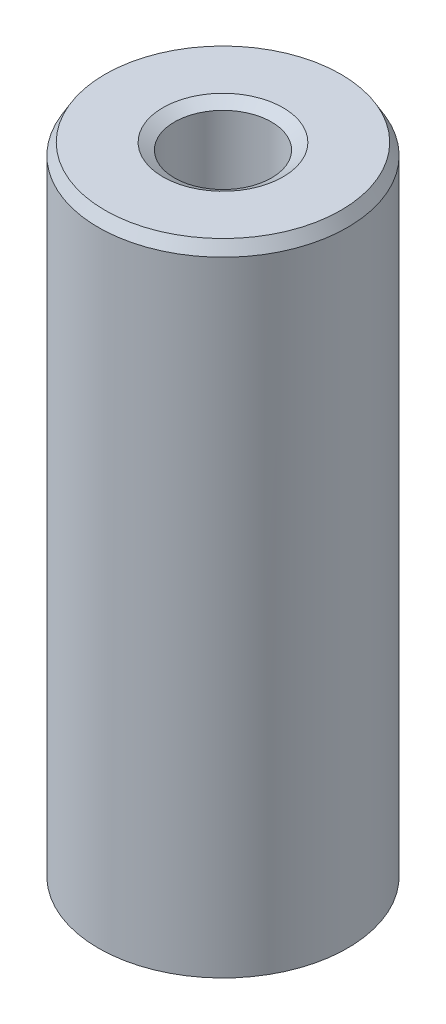
ISO-10303-21;
HEADER;
FILE_DESCRIPTION(('STEP AP214'),'2;1');
FILE_NAME('part.step','',(''),(''),'','','');
FILE_SCHEMA(('AUTOMOTIVE_DESIGN { 1 0 10303 214 1 1 1 1 }'));
ENDSEC;
DATA;
#1=APPLICATION_CONTEXT('core data for automotive mechanical design processes');
#2=APPLICATION_PROTOCOL_DEFINITION('international standard','automotive_design',2000,#1);
#3=PRODUCT_CONTEXT('',#1,'mechanical');
#4=PRODUCT('Part','Part','',(#3));
#5=PRODUCT_RELATED_PRODUCT_CATEGORY('part','',(#4));
#6=PRODUCT_DEFINITION_FORMATION('','',#4);
#7=PRODUCT_DEFINITION_CONTEXT('part definition',#1,'design');
#8=PRODUCT_DEFINITION('design','',#6,#7);
#9=PRODUCT_DEFINITION_SHAPE('','',#8);
#10=(LENGTH_UNIT() NAMED_UNIT(*) SI_UNIT(.MILLI.,.METRE.));
#11=(NAMED_UNIT(*) PLANE_ANGLE_UNIT() SI_UNIT($,.RADIAN.));
#12=(NAMED_UNIT(*) SI_UNIT($,.STERADIAN.) SOLID_ANGLE_UNIT());
#13=UNCERTAINTY_MEASURE_WITH_UNIT(LENGTH_MEASURE(1.E-05),#10,'distance_accuracy_value','');
#14=(GEOMETRIC_REPRESENTATION_CONTEXT(3) GLOBAL_UNCERTAINTY_ASSIGNED_CONTEXT((#13)) GLOBAL_UNIT_ASSIGNED_CONTEXT((#10,
#11,#12)) REPRESENTATION_CONTEXT('',''));
#15=CARTESIAN_POINT('',(0.,0.,0.));
#16=DIRECTION('',(0.,0.,1.));
#17=DIRECTION('',(1.,0.,0.));
#18=AXIS2_PLACEMENT_3D('',#15,#16,#17);
#19=CARTESIAN_POINT('',(0.,180.484742913533,0.));
#20=DIRECTION('',(0.,-1.,0.));
#21=DIRECTION('',(0.,0.,-1.));
#22=AXIS2_PLACEMENT_3D('',#19,#20,#21);
#23=CYLINDRICAL_SURFACE('',#22,35.);
#24=CARTESIAN_POINT('',(0.,1.86802596022742,0.));
#25=DIRECTION('',(0.,1.,0.));
#26=DIRECTION('',(0.,0.,1.));
#27=AXIS2_PLACEMENT_3D('',#24,#25,#26);
#28=CIRCLE('',#27,35.);
#29=CARTESIAN_POINT('',(0.,1.86802596022742,35.));
#30=VERTEX_POINT('',#29);
#31=EDGE_CURVE('E10',#30,#30,#28,.T.);
#32=ORIENTED_EDGE('',*,*,#31,.T.);
#33=EDGE_LOOP('',(#32));
#34=FACE_BOUND('',#33,.T.);
#35=CARTESIAN_POINT('',(0.,177.249227040561,0.));
#36=DIRECTION('',(0.,1.,0.));
#37=DIRECTION('',(0.,0.,1.));
#38=AXIS2_PLACEMENT_3D('',#35,#36,#37);
#39=CIRCLE('',#38,35.);
#40=CARTESIAN_POINT('',(0.,177.249227040561,-35.));
#41=VERTEX_POINT('',#40);
#42=EDGE_CURVE('E50',#41,#41,#39,.F.);
#43=ORIENTED_EDGE('',*,*,#42,.T.);
#44=EDGE_LOOP('',(#43));
#45=FACE_BOUND('',#44,.T.);
#46=ADVANCED_FACE('F39',(#34,#45),#23,.T.);
#47=CARTESIAN_POINT('',(0.,180.484742913533,0.));
#48=DIRECTION('',(0.,1.,0.));
#49=DIRECTION('',(0.,0.,1.));
#50=AXIS2_PLACEMENT_3D('',#47,#48,#49);
#51=PLANE('',#50);
#52=CARTESIAN_POINT('',(0.,180.484742913533,0.));
#53=DIRECTION('',(0.,1.,0.));
#54=DIRECTION('',(0.,0.,1.));
#55=AXIS2_PLACEMENT_3D('',#52,#53,#54);
#56=CIRCLE('',#55,16.8723935439699);
#57=CARTESIAN_POINT('',(0.,180.484742913533,16.8723935439698));
#58=VERTEX_POINT('',#57);
#59=EDGE_CURVE('E58',#58,#58,#56,.F.);
#60=ORIENTED_EDGE('',*,*,#59,.T.);
#61=EDGE_LOOP('',(#60));
#62=FACE_BOUND('',#61,.T.);
#63=CARTESIAN_POINT('',(0.,180.484742913533,0.));
#64=DIRECTION('',(0.,1.,0.));
#65=DIRECTION('',(0.,0.,1.));
#66=AXIS2_PLACEMENT_3D('',#63,#64,#65);
#67=CIRCLE('',#66,33.1319740397725);
#68=CARTESIAN_POINT('',(0.,180.484742913533,-33.1319740397726));
#69=VERTEX_POINT('',#68);
#70=EDGE_CURVE('E61',#69,#69,#67,.T.);
#71=ORIENTED_EDGE('',*,*,#70,.T.);
#72=EDGE_LOOP('',(#71));
#73=FACE_BOUND('',#72,.T.);
#74=ADVANCED_FACE('F88',(#62,#73),#51,.T.);
#75=CARTESIAN_POINT('',(0.,0.,0.));
#76=DIRECTION('',(0.,1.,0.));
#77=DIRECTION('',(0.,0.,1.));
#78=AXIS2_PLACEMENT_3D('',#75,#76,#77);
#79=PLANE('',#78);
#80=CARTESIAN_POINT('',(0.,0.,0.));
#81=DIRECTION('',(0.,1.,0.));
#82=DIRECTION('',(0.,0.,1.));
#83=AXIS2_PLACEMENT_3D('',#80,#81,#82);
#84=CIRCLE('',#83,15.5049036312257);
#85=CARTESIAN_POINT('',(0.,0.,15.5049036312257));
#86=VERTEX_POINT('',#85);
#87=EDGE_CURVE('E51',#86,#86,#84,.T.);
#88=ORIENTED_EDGE('',*,*,#87,.T.);
#89=EDGE_LOOP('',(#88));
#90=FACE_BOUND('',#89,.T.);
#91=CARTESIAN_POINT('',(0.,0.,0.));
#92=DIRECTION('',(0.,1.,0.));
#93=DIRECTION('',(0.,0.,1.));
#94=AXIS2_PLACEMENT_3D('',#91,#92,#93);
#95=CIRCLE('',#94,31.7644841270285);
#96=CARTESIAN_POINT('',(0.,0.,31.7644841270285));
#97=VERTEX_POINT('',#96);
#98=EDGE_CURVE('E54',#97,#97,#95,.F.);
#99=ORIENTED_EDGE('',*,*,#98,.T.);
#100=EDGE_LOOP('',(#99));
#101=FACE_BOUND('',#100,.T.);
#102=ADVANCED_FACE('F83',(#90,#101),#79,.F.);
#103=CARTESIAN_POINT('',(0.,180.484742913533,0.));
#104=DIRECTION('',(0.,-1.,0.));
#105=DIRECTION('',(0.,0.,-1.));
#106=AXIS2_PLACEMENT_3D('',#103,#104,#105);
#107=CYLINDRICAL_SURFACE('',#106,13.6368776709983);
#108=CARTESIAN_POINT('',(0.,178.616716953305,0.));
#109=DIRECTION('',(0.,1.,0.));
#110=DIRECTION('',(0.,0.,1.));
#111=AXIS2_PLACEMENT_3D('',#108,#109,#110);
#112=CIRCLE('',#111,13.6368776709983);
#113=CARTESIAN_POINT('',(0.,178.616716953305,13.6368776709983));
#114=VERTEX_POINT('',#113);
#115=EDGE_CURVE('E67',#114,#114,#112,.T.);
#116=ORIENTED_EDGE('',*,*,#115,.T.);
#117=EDGE_LOOP('',(#116));
#118=FACE_BOUND('',#117,.T.);
#119=CARTESIAN_POINT('',(0.,3.23551587297152,0.));
#120=DIRECTION('',(0.,1.,0.));
#121=DIRECTION('',(0.,0.,1.));
#122=AXIS2_PLACEMENT_3D('',#119,#120,#121);
#123=CIRCLE('',#122,13.6368776709983);
#124=CARTESIAN_POINT('',(0.,3.23551587297152,13.6368776709983));
#125=VERTEX_POINT('',#124);
#126=EDGE_CURVE('E69',#125,#125,#123,.F.);
#127=ORIENTED_EDGE('',*,*,#126,.T.);
#128=EDGE_LOOP('',(#127));
#129=FACE_BOUND('',#128,.T.);
#130=ADVANCED_FACE('F71',(#118,#129),#107,.F.);
#131=CARTESIAN_POINT('',(0.,178.616716953305,0.));
#132=DIRECTION('',(0.,1.,0.));
#133=DIRECTION('',(0.,0.,1.));
#134=AXIS2_PLACEMENT_3D('',#131,#132,#133);
#135=CONICAL_SURFACE('',#134,13.6368776709983,1.0471975511966);
#136=CARTESIAN_POINT('',(0.,180.484742913533,16.8723935439698));
#137=CARTESIAN_POINT('',(0.,180.46528430978,16.8386902536264));
#138=CARTESIAN_POINT('',(0.,180.445825706028,16.8049869632829));
#139=CARTESIAN_POINT('',(0.,180.406908498523,16.737580382596));
#140=CARTESIAN_POINT('',(0.,180.387449894771,16.7038770922526));
#141=CARTESIAN_POINT('',(0.,180.348532687266,16.6364705115657));
#142=CARTESIAN_POINT('',(0.,180.329074083514,16.6027672212222));
#143=CARTESIAN_POINT('',(0.,180.290156876009,16.5353606405353));
#144=CARTESIAN_POINT('',(0.,180.270698272257,16.5016573501918));
#145=CARTESIAN_POINT('',(0.,180.231781064752,16.4342507695049));
#146=CARTESIAN_POINT('',(0.,180.212322461,16.4005474791615));
#147=CARTESIAN_POINT('',(0.,180.173405253495,16.3331408984746));
#148=CARTESIAN_POINT('',(0.,180.153946649743,16.2994376081311));
#149=CARTESIAN_POINT('',(0.,180.115029442238,16.2320310274442));
#150=CARTESIAN_POINT('',(0.,180.095570838485,16.1983277371008));
#151=CARTESIAN_POINT('',(0.,180.056653630981,16.1309211564138));
#152=CARTESIAN_POINT('',(0.,180.037195027228,16.0972178660704));
#153=CARTESIAN_POINT('',(0.,179.998277819724,16.0298112853835));
#154=CARTESIAN_POINT('',(0.,179.978819215971,15.99610799504));
#155=CARTESIAN_POINT('',(0.,179.939902008467,15.9287014143531));
#156=CARTESIAN_POINT('',(0.,179.920443404714,15.8949981240097));
#157=CARTESIAN_POINT('',(0.,179.881526197209,15.8275915433228));
#158=CARTESIAN_POINT('',(0.,179.862067593457,15.7938882529793));
#159=CARTESIAN_POINT('',(0.,179.823150385952,15.7264816722924));
#160=CARTESIAN_POINT('',(0.,179.8036917822,15.6927783819489));
#161=CARTESIAN_POINT('',(0.,179.764774574695,15.625371801262));
#162=CARTESIAN_POINT('',(0.,179.745315970943,15.5916685109186));
#163=CARTESIAN_POINT('',(0.,179.706398763438,15.5242619302317));
#164=CARTESIAN_POINT('',(0.,179.686940159686,15.4905586398882));
#165=CARTESIAN_POINT('',(0.,179.648022952181,15.4231520592013));
#166=CARTESIAN_POINT('',(0.,179.628564348429,15.3894487688579));
#167=CARTESIAN_POINT('',(0.,179.589647140924,15.322042188171));
#168=CARTESIAN_POINT('',(0.,179.570188537172,15.2883388978275));
#169=CARTESIAN_POINT('',(0.,179.531271329667,15.2209323171406));
#170=CARTESIAN_POINT('',(0.,179.511812725914,15.1872290267971));
#171=CARTESIAN_POINT('',(0.,179.47289551841,15.1198224461102));
#172=CARTESIAN_POINT('',(0.,179.453436914657,15.0861191557668));
#173=CARTESIAN_POINT('',(0.,179.414519707153,15.0187125750799));
#174=CARTESIAN_POINT('',(0.,179.3950611034,14.9850092847364));
#175=CARTESIAN_POINT('',(0.,179.356143895895,14.9176027040495));
#176=CARTESIAN_POINT('',(0.,179.336685292143,14.8838994137061));
#177=CARTESIAN_POINT('',(0.,179.297768084638,14.8164928330191));
#178=CARTESIAN_POINT('',(0.,179.278309480886,14.7827895426757));
#179=CARTESIAN_POINT('',(0.,179.239392273381,14.7153829619888));
#180=CARTESIAN_POINT('',(0.,179.219933669629,14.6816796716453));
#181=CARTESIAN_POINT('',(0.,179.181016462124,14.6142730909584));
#182=CARTESIAN_POINT('',(0.,179.161557858372,14.580569800615));
#183=CARTESIAN_POINT('',(0.,179.122640650867,14.5131632199281));
#184=CARTESIAN_POINT('',(0.,179.103182047115,14.4794599295846));
#185=CARTESIAN_POINT('',(0.,179.06426483961,14.4120533488977));
#186=CARTESIAN_POINT('',(0.,179.044806235858,14.3783500585543));
#187=CARTESIAN_POINT('',(0.,179.005889028353,14.3109434778673));
#188=CARTESIAN_POINT('',(0.,178.9864304246,14.2772401875239));
#189=CARTESIAN_POINT('',(0.,178.947513217096,14.209833606837));
#190=CARTESIAN_POINT('',(0.,178.928054613343,14.1761303164935));
#191=CARTESIAN_POINT('',(0.,178.889137405839,14.1087237358066));
#192=CARTESIAN_POINT('',(0.,178.869678802086,14.0750204454632));
#193=CARTESIAN_POINT('',(0.,178.830761594581,14.0076138647763));
#194=CARTESIAN_POINT('',(0.,178.811302990829,13.9739105744328));
#195=CARTESIAN_POINT('',(0.,178.772385783324,13.9065039937459));
#196=CARTESIAN_POINT('',(0.,178.752927179572,13.8728007034024));
#197=CARTESIAN_POINT('',(0.,178.714009972067,13.8053941227155));
#198=CARTESIAN_POINT('',(0.,178.694551368315,13.7716908323721));
#199=CARTESIAN_POINT('',(0.,178.65563416081,13.7042842516852));
#200=CARTESIAN_POINT('',(0.,178.636175557058,13.6705809613417));
#201=CARTESIAN_POINT('',(0.,178.616716953305,13.6368776709983));
#202=B_SPLINE_CURVE_WITH_KNOTS('',3,(#136,#137,#138,#139,#140,#141,#142,#143,#144,#145,#146,
#147,#148,#149,#150,#151,#152,#153,#154,#155,#156,#157,#158,#159,#160,#161,#162,#163,#164,#165,
#166,#167,#168,#169,#170,#171,#172,#173,#174,#175,#176,#177,#178,#179,#180,#181,#182,#183,#184,
#185,#186,#187,#188,#189,#190,#191,#192,#193,#194,#195,#196,#197,#198,#199,#200,#201),
.UNSPECIFIED.,.F.,.F.,(4,2,2,2,2,2,2,2,2,2,2,2,2,2,2,2,2,2,2,2,2,2,2,2,2,2,2,2,2,2,2,2,4),(0.,
0.116751622514219,0.233503245028438,0.350254867542657,0.467006490056862,0.583758112571085,
0.700509735085304,0.817261357599509,0.934012980113728,1.05076460262795,1.16751622514215,
1.28426784765637,1.40101947017059,1.5177710926848,1.63452271519902,1.75127433771324,
1.86802596022744,1.98477758274166,2.10152920525588,2.2182808277701,2.33503245028431,
2.45178407279853,2.56853569531274,2.68528731782695,2.80203894034117,2.91879056285539,
3.0355421853696,3.15229380788382,3.26904543039804,3.38579705291224,3.50254867542646,
3.61930029794068,3.73605192045489),.UNSPECIFIED.);
#203=EDGE_CURVE('BSEAM77',#58,#114,#202,.T.);
#204=ORIENTED_EDGE('',*,*,#59,.F.);
#205=ORIENTED_EDGE('',*,*,#115,.F.);
#206=ORIENTED_EDGE('',*,*,#203,.T.);
#207=ORIENTED_EDGE('',*,*,#203,.F.);
#208=EDGE_LOOP('',(#204,#206,#205,#207));
#209=FACE_BOUND('',#208,.T.);
#210=ADVANCED_FACE('F77',(#209),#135,.F.);
#211=CARTESIAN_POINT('',(0.,0.,0.));
#212=DIRECTION('',(0.,-1.,0.));
#213=DIRECTION('',(0.,0.,-1.));
#214=AXIS2_PLACEMENT_3D('',#211,#212,#213);
#215=CONICAL_SURFACE('',#214,15.5049036312257,0.523598775598298);
#216=ORIENTED_EDGE('',*,*,#126,.F.);
#217=EDGE_LOOP('',(#216));
#218=FACE_BOUND('',#217,.T.);
#219=ORIENTED_EDGE('',*,*,#87,.F.);
#220=EDGE_LOOP('',(#219));
#221=FACE_BOUND('',#220,.T.);
#222=ADVANCED_FACE('F73',(#218,#221),#215,.F.);
#223=CARTESIAN_POINT('',(0.,1.86802596022742,0.));
#224=DIRECTION('',(0.,1.,0.));
#225=DIRECTION('',(0.,0.,1.));
#226=AXIS2_PLACEMENT_3D('',#223,#224,#225);
#227=CONICAL_SURFACE('',#226,35.,1.0471975511966);
#228=ORIENTED_EDGE('',*,*,#98,.F.);
#229=EDGE_LOOP('',(#228));
#230=FACE_BOUND('',#229,.T.);
#231=ORIENTED_EDGE('',*,*,#31,.F.);
#232=EDGE_LOOP('',(#231));
#233=FACE_BOUND('',#232,.T.);
#234=ADVANCED_FACE('F76',(#230,#233),#227,.T.);
#235=CARTESIAN_POINT('',(0.,180.484742913533,0.));
#236=DIRECTION('',(0.,-1.,0.));
#237=DIRECTION('',(0.,0.,-1.));
#238=AXIS2_PLACEMENT_3D('',#235,#236,#237);
#239=CONICAL_SURFACE('',#238,33.1319740397725,0.523598775598296);
#240=CARTESIAN_POINT('',(0.,177.249227040561,-35.));
#241=CARTESIAN_POINT('',(0.,177.282930330905,-34.9805413962476));
#242=CARTESIAN_POINT('',(0.,177.316633621248,-34.9610827924953));
#243=CARTESIAN_POINT('',(0.,177.384040201935,-34.9221655849905));
#244=CARTESIAN_POINT('',(0.,177.417743492278,-34.9027069812382));
#245=CARTESIAN_POINT('',(0.,177.485150072965,-34.8637897737334));
#246=CARTESIAN_POINT('',(0.,177.518853363309,-34.8443311699811));
#247=CARTESIAN_POINT('',(0.,177.586259943996,-34.8054139624763));
#248=CARTESIAN_POINT('',(0.,177.619963234339,-34.785955358724));
#249=CARTESIAN_POINT('',(0.,177.687369815026,-34.7470381512192));
#250=CARTESIAN_POINT('',(0.,177.72107310537,-34.7275795474668));
#251=CARTESIAN_POINT('',(0.,177.788479686056,-34.6886623399621));
#252=CARTESIAN_POINT('',(0.,177.8221829764,-34.6692037362097));
#253=CARTESIAN_POINT('',(0.,177.889589557087,-34.630286528705));
#254=CARTESIAN_POINT('',(0.,177.92329284743,-34.6108279249526));
#255=CARTESIAN_POINT('',(0.,177.990699428117,-34.5719107174479));
#256=CARTESIAN_POINT('',(0.,178.024402718461,-34.5524521136955));
#257=CARTESIAN_POINT('',(0.,178.091809299148,-34.5135349061908));
#258=CARTESIAN_POINT('',(0.,178.125512589491,-34.4940763024384));
#259=CARTESIAN_POINT('',(0.,178.192919170178,-34.4551590949337));
#260=CARTESIAN_POINT('',(0.,178.226622460521,-34.4357004911813));
#261=CARTESIAN_POINT('',(0.,178.294029041208,-34.3967832836766));
#262=CARTESIAN_POINT('',(0.,178.327732331552,-34.3773246799242));
#263=CARTESIAN_POINT('',(0.,178.395138912239,-34.3384074724195));
#264=CARTESIAN_POINT('',(0.,178.428842202582,-34.3189488686671));
#265=CARTESIAN_POINT('',(0.,178.496248783269,-34.2800316611623));
#266=CARTESIAN_POINT('',(0.,178.529952073612,-34.26057305741));
#267=CARTESIAN_POINT('',(0.,178.597358654299,-34.2216558499052));
#268=CARTESIAN_POINT('',(0.,178.631061944643,-34.2021972461529));
#269=CARTESIAN_POINT('',(0.,178.69846852533,-34.1632800386481));
#270=CARTESIAN_POINT('',(0.,178.732171815673,-34.1438214348958));
#271=CARTESIAN_POINT('',(0.,178.79957839636,-34.104904227391));
#272=CARTESIAN_POINT('',(0.,178.833281686704,-34.0854456236387));
#273=CARTESIAN_POINT('',(0.,178.900688267391,-34.0465284161339));
#274=CARTESIAN_POINT('',(0.,178.934391557734,-34.0270698123815));
#275=CARTESIAN_POINT('',(0.,179.001798138421,-33.9881526048768));
#276=CARTESIAN_POINT('',(0.,179.035501428764,-33.9686940011244));
#277=CARTESIAN_POINT('',(0.,179.102908009451,-33.9297767936197));
#278=CARTESIAN_POINT('',(0.,179.136611299795,-33.9103181898673));
#279=CARTESIAN_POINT('',(0.,179.204017880482,-33.8714009823626));
#280=CARTESIAN_POINT('',(0.,179.237721170825,-33.8519423786102));
#281=CARTESIAN_POINT('',(0.,179.305127751512,-33.8130251711055));
#282=CARTESIAN_POINT('',(0.,179.338831041855,-33.7935665673531));
#283=CARTESIAN_POINT('',(0.,179.406237622542,-33.7546493598484));
#284=CARTESIAN_POINT('',(0.,179.439940912886,-33.735190756096));
#285=CARTESIAN_POINT('',(0.,179.507347493573,-33.6962735485913));
#286=CARTESIAN_POINT('',(0.,179.541050783916,-33.6768149448389));
#287=CARTESIAN_POINT('',(0.,179.608457364603,-33.6378977373341));
#288=CARTESIAN_POINT('',(0.,179.642160654946,-33.6184391335818));
#289=CARTESIAN_POINT('',(0.,179.709567235633,-33.579521926077));
#290=CARTESIAN_POINT('',(0.,179.743270525977,-33.5600633223247));
#291=CARTESIAN_POINT('',(0.,179.810677106664,-33.5211461148199));
#292=CARTESIAN_POINT('',(0.,179.844380397007,-33.5016875110676));
#293=CARTESIAN_POINT('',(0.,179.911786977694,-33.4627703035628));
#294=CARTESIAN_POINT('',(0.,179.945490268038,-33.4433116998105));
#295=CARTESIAN_POINT('',(0.,180.012896848724,-33.4043944923057));
#296=CARTESIAN_POINT('',(0.,180.046600139068,-33.3849358885534));
#297=CARTESIAN_POINT('',(0.,180.114006719755,-33.3460186810486));
#298=CARTESIAN_POINT('',(0.,180.147710010098,-33.3265600772963));
#299=CARTESIAN_POINT('',(0.,180.215116590785,-33.2876428697915));
#300=CARTESIAN_POINT('',(0.,180.248819881129,-33.2681842660391));
#301=CARTESIAN_POINT('',(0.,180.316226461816,-33.2292670585344));
#302=CARTESIAN_POINT('',(0.,180.349929752159,-33.209808454782));
#303=CARTESIAN_POINT('',(0.,180.417336332846,-33.1708912472773));
#304=CARTESIAN_POINT('',(0.,180.451039623189,-33.1514326435249));
#305=CARTESIAN_POINT('',(0.,180.484742913533,-33.1319740397726));
#306=B_SPLINE_CURVE_WITH_KNOTS('',3,(#240,#241,#242,#243,#244,#245,#246,#247,#248,#249,#250,
#251,#252,#253,#254,#255,#256,#257,#258,#259,#260,#261,#262,#263,#264,#265,#266,#267,#268,#269,
#270,#271,#272,#273,#274,#275,#276,#277,#278,#279,#280,#281,#282,#283,#284,#285,#286,#287,#288,
#289,#290,#291,#292,#293,#294,#295,#296,#297,#298,#299,#300,#301,#302,#303,#304,#305),
.UNSPECIFIED.,.F.,.F.,(4,2,2,2,2,2,2,2,2,2,2,2,2,2,2,2,2,2,2,2,2,2,2,2,2,2,2,2,2,2,2,2,4),(0.,
0.116751622514228,0.233503245028452,0.350254867542655,0.467006490056883,0.583758112571087,
0.700509735085314,0.817261357599542,0.934012980113745,1.05076460262797,1.16751622514217,
1.2842678476564,1.40101947017063,1.51777109268483,1.63452271519906,1.75127433771326,
1.86802596022749,1.98477758274172,2.10152920525592,2.21828082777015,2.33503245028435,
2.45178407279858,2.5685356953128,2.685287317827,2.80203894034123,2.91879056285544,
3.03554218536966,3.15229380788389,3.26904543039809,3.38579705291232,3.50254867542652,
3.61930029794075,3.73605192045498),.UNSPECIFIED.);
#307=EDGE_CURVE('BSEAM45',#41,#69,#306,.T.);
#308=ORIENTED_EDGE('',*,*,#42,.F.);
#309=ORIENTED_EDGE('',*,*,#70,.F.);
#310=ORIENTED_EDGE('',*,*,#307,.T.);
#311=ORIENTED_EDGE('',*,*,#307,.F.);
#312=EDGE_LOOP('',(#308,#310,#309,#311));
#313=FACE_BOUND('',#312,.T.);
#314=ADVANCED_FACE('F45',(#313),#239,.T.);
#315=CLOSED_SHELL('',(#46,#74,#102,#130,#210,#222,#234,#314));
#316=MANIFOLD_SOLID_BREP('B2',#315);
#317=ADVANCED_BREP_SHAPE_REPRESENTATION('',(#18,#316),#14);
#318=SHAPE_DEFINITION_REPRESENTATION(#9,#317);
ENDSEC;
END-ISO-10303-21;
